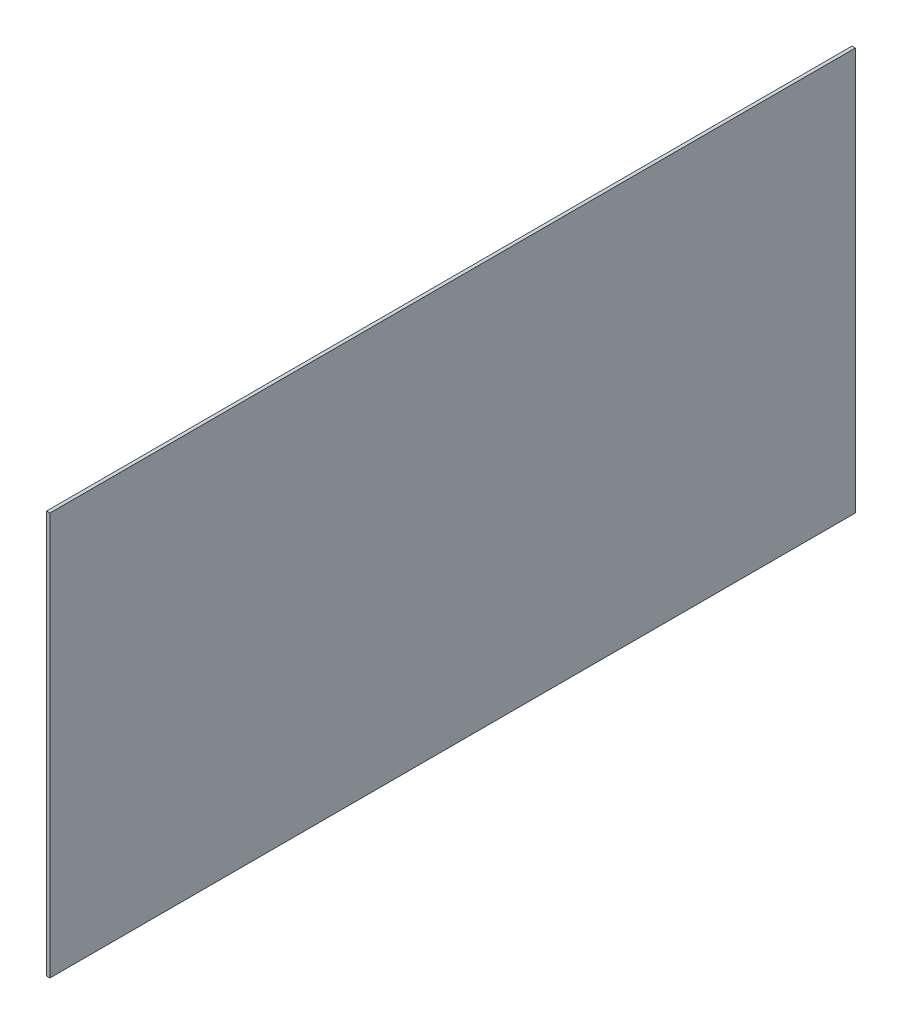
ISO-10303-21;
HEADER;
FILE_DESCRIPTION(('STEP AP214'),'2;1');
FILE_NAME('part.step','',(''),(''),'','','');
FILE_SCHEMA(('AUTOMOTIVE_DESIGN { 1 0 10303 214 1 1 1 1 }'));
ENDSEC;
DATA;
#1=APPLICATION_CONTEXT('core data for automotive mechanical design processes');
#2=APPLICATION_PROTOCOL_DEFINITION('international standard','automotive_design',2000,#1);
#3=PRODUCT_CONTEXT('',#1,'mechanical');
#4=PRODUCT('Part','Part','',(#3));
#5=PRODUCT_RELATED_PRODUCT_CATEGORY('part','',(#4));
#6=PRODUCT_DEFINITION_FORMATION('','',#4);
#7=PRODUCT_DEFINITION_CONTEXT('part definition',#1,'design');
#8=PRODUCT_DEFINITION('design','',#6,#7);
#9=PRODUCT_DEFINITION_SHAPE('','',#8);
#10=(LENGTH_UNIT() NAMED_UNIT(*) SI_UNIT(.MILLI.,.METRE.));
#11=(NAMED_UNIT(*) PLANE_ANGLE_UNIT() SI_UNIT($,.RADIAN.));
#12=(NAMED_UNIT(*) SI_UNIT($,.STERADIAN.) SOLID_ANGLE_UNIT());
#13=UNCERTAINTY_MEASURE_WITH_UNIT(LENGTH_MEASURE(1.E-05),#10,'distance_accuracy_value','');
#14=(GEOMETRIC_REPRESENTATION_CONTEXT(3) GLOBAL_UNCERTAINTY_ASSIGNED_CONTEXT((#13)) GLOBAL_UNIT_ASSIGNED_CONTEXT((#10,
#11,#12)) REPRESENTATION_CONTEXT('',''));
#15=CARTESIAN_POINT('',(0.,0.,0.));
#16=DIRECTION('',(0.,0.,1.));
#17=DIRECTION('',(1.,0.,0.));
#18=AXIS2_PLACEMENT_3D('',#15,#16,#17);
#19=CARTESIAN_POINT('',(2.54,152.4,-304.8));
#20=DIRECTION('',(0.,0.,1.));
#21=DIRECTION('',(1.,0.,0.));
#22=AXIS2_PLACEMENT_3D('',#19,#20,#21);
#23=PLANE('',#22);
#24=DIRECTION('',(0.,1.,0.));
#25=VECTOR('',#24,1.);
#26=CARTESIAN_POINT('',(0.,152.4,-304.8));
#27=LINE('',#26,#25);
#28=CARTESIAN_POINT('',(0.,-152.4,-304.8));
#29=VERTEX_POINT('',#28);
#30=CARTESIAN_POINT('',(0.,152.4,-304.8));
#31=VERTEX_POINT('',#30);
#32=EDGE_CURVE('E96',#29,#31,#27,.T.);
#33=ORIENTED_EDGE('',*,*,#32,.T.);
#34=DIRECTION('',(-1.,0.,0.));
#35=VECTOR('',#34,1.);
#36=CARTESIAN_POINT('',(2.54,152.4,-304.8));
#37=LINE('',#36,#35);
#38=CARTESIAN_POINT('',(2.54,152.4,-304.8));
#39=VERTEX_POINT('',#38);
#40=EDGE_CURVE('E11',#39,#31,#37,.T.);
#41=ORIENTED_EDGE('',*,*,#40,.F.);
#42=DIRECTION('',(0.,1.,0.));
#43=VECTOR('',#42,1.);
#44=CARTESIAN_POINT('',(2.54,152.4,-304.8));
#45=LINE('',#44,#43);
#46=CARTESIAN_POINT('',(2.54,-152.4,-304.8));
#47=VERTEX_POINT('',#46);
#48=EDGE_CURVE('E84',#47,#39,#45,.T.);
#49=ORIENTED_EDGE('',*,*,#48,.F.);
#50=DIRECTION('',(-1.,0.,0.));
#51=VECTOR('',#50,1.);
#52=CARTESIAN_POINT('',(2.54,-152.4,-304.8));
#53=LINE('',#52,#51);
#54=EDGE_CURVE('E92',#47,#29,#53,.T.);
#55=ORIENTED_EDGE('',*,*,#54,.T.);
#56=EDGE_LOOP('',(#33,#41,#49,#55));
#57=FACE_BOUND('',#56,.T.);
#58=ADVANCED_FACE('F33',(#57),#23,.F.);
#59=CARTESIAN_POINT('',(2.54,152.4,304.8));
#60=DIRECTION('',(0.,-1.,0.));
#61=DIRECTION('',(0.,0.,-1.));
#62=AXIS2_PLACEMENT_3D('',#59,#60,#61);
#63=PLANE('',#62);
#64=DIRECTION('',(0.,0.,1.));
#65=VECTOR('',#64,1.);
#66=CARTESIAN_POINT('',(0.,152.4,304.8));
#67=LINE('',#66,#65);
#68=CARTESIAN_POINT('',(0.,152.4,304.8));
#69=VERTEX_POINT('',#68);
#70=EDGE_CURVE('E88',#31,#69,#67,.T.);
#71=ORIENTED_EDGE('',*,*,#70,.T.);
#72=DIRECTION('',(-1.,0.,0.));
#73=VECTOR('',#72,1.);
#74=CARTESIAN_POINT('',(2.54,152.4,304.8));
#75=LINE('',#74,#73);
#76=CARTESIAN_POINT('',(2.54,152.4,304.8));
#77=VERTEX_POINT('',#76);
#78=EDGE_CURVE('E41',#77,#69,#75,.T.);
#79=ORIENTED_EDGE('',*,*,#78,.F.);
#80=DIRECTION('',(0.,0.,1.));
#81=VECTOR('',#80,1.);
#82=CARTESIAN_POINT('',(2.54,152.4,304.8));
#83=LINE('',#82,#81);
#84=EDGE_CURVE('E79',#39,#77,#83,.T.);
#85=ORIENTED_EDGE('',*,*,#84,.F.);
#86=ORIENTED_EDGE('',*,*,#40,.T.);
#87=EDGE_LOOP('',(#71,#79,#85,#86));
#88=FACE_BOUND('',#87,.T.);
#89=ADVANCED_FACE('F87',(#88),#63,.F.);
#90=CARTESIAN_POINT('',(2.54,152.4,304.8));
#91=DIRECTION('',(0.,0.,-1.));
#92=DIRECTION('',(-1.,0.,0.));
#93=AXIS2_PLACEMENT_3D('',#90,#91,#92);
#94=PLANE('',#93);
#95=DIRECTION('',(0.,-1.,0.));
#96=VECTOR('',#95,1.);
#97=CARTESIAN_POINT('',(0.,152.4,304.8));
#98=LINE('',#97,#96);
#99=CARTESIAN_POINT('',(0.,-152.4,304.8));
#100=VERTEX_POINT('',#99);
#101=EDGE_CURVE('E66',#69,#100,#98,.T.);
#102=ORIENTED_EDGE('',*,*,#101,.T.);
#103=DIRECTION('',(-1.,0.,0.));
#104=VECTOR('',#103,1.);
#105=CARTESIAN_POINT('',(2.54,-152.4,304.8));
#106=LINE('',#105,#104);
#107=CARTESIAN_POINT('',(2.54,-152.4,304.8));
#108=VERTEX_POINT('',#107);
#109=EDGE_CURVE('E89',#108,#100,#106,.T.);
#110=ORIENTED_EDGE('',*,*,#109,.F.);
#111=DIRECTION('',(0.,-1.,0.));
#112=VECTOR('',#111,1.);
#113=CARTESIAN_POINT('',(2.54,152.4,304.8));
#114=LINE('',#113,#112);
#115=EDGE_CURVE('E82',#77,#108,#114,.T.);
#116=ORIENTED_EDGE('',*,*,#115,.F.);
#117=ORIENTED_EDGE('',*,*,#78,.T.);
#118=EDGE_LOOP('',(#102,#110,#116,#117));
#119=FACE_BOUND('',#118,.T.);
#120=ADVANCED_FACE('F90',(#119),#94,.F.);
#121=CARTESIAN_POINT('',(2.54,-152.4,304.8));
#122=DIRECTION('',(0.,1.,0.));
#123=DIRECTION('',(0.,0.,1.));
#124=AXIS2_PLACEMENT_3D('',#121,#122,#123);
#125=PLANE('',#124);
#126=DIRECTION('',(0.,0.,-1.));
#127=VECTOR('',#126,1.);
#128=CARTESIAN_POINT('',(0.,-152.4,304.8));
#129=LINE('',#128,#127);
#130=EDGE_CURVE('E72',#100,#29,#129,.T.);
#131=ORIENTED_EDGE('',*,*,#130,.T.);
#132=ORIENTED_EDGE('',*,*,#54,.F.);
#133=DIRECTION('',(0.,0.,-1.));
#134=VECTOR('',#133,1.);
#135=CARTESIAN_POINT('',(2.54,-152.4,304.8));
#136=LINE('',#135,#134);
#137=EDGE_CURVE('E49',#108,#47,#136,.T.);
#138=ORIENTED_EDGE('',*,*,#137,.F.);
#139=ORIENTED_EDGE('',*,*,#109,.T.);
#140=EDGE_LOOP('',(#131,#132,#138,#139));
#141=FACE_BOUND('',#140,.T.);
#142=ADVANCED_FACE('F103',(#141),#125,.F.);
#143=CARTESIAN_POINT('',(2.54,0.,0.));
#144=DIRECTION('',(1.,0.,0.));
#145=DIRECTION('',(0.,0.,-1.));
#146=AXIS2_PLACEMENT_3D('',#143,#144,#145);
#147=PLANE('',#146);
#148=ORIENTED_EDGE('',*,*,#48,.T.);
#149=ORIENTED_EDGE('',*,*,#84,.T.);
#150=ORIENTED_EDGE('',*,*,#115,.T.);
#151=ORIENTED_EDGE('',*,*,#137,.T.);
#152=EDGE_LOOP('',(#148,#149,#150,#151));
#153=FACE_BOUND('',#152,.T.);
#154=ADVANCED_FACE('F80',(#153),#147,.T.);
#155=CARTESIAN_POINT('',(0.,0.,0.));
#156=DIRECTION('',(1.,0.,0.));
#157=DIRECTION('',(0.,0.,-1.));
#158=AXIS2_PLACEMENT_3D('',#155,#156,#157);
#159=PLANE('',#158);
#160=ORIENTED_EDGE('',*,*,#32,.F.);
#161=ORIENTED_EDGE('',*,*,#130,.F.);
#162=ORIENTED_EDGE('',*,*,#101,.F.);
#163=ORIENTED_EDGE('',*,*,#70,.F.);
#164=EDGE_LOOP('',(#160,#161,#162,#163));
#165=FACE_BOUND('',#164,.T.);
#166=ADVANCED_FACE('F106',(#165),#159,.F.);
#167=CLOSED_SHELL('',(#58,#89,#120,#142,#154,#166));
#168=MANIFOLD_SOLID_BREP('B2',#167);
#169=ADVANCED_BREP_SHAPE_REPRESENTATION('',(#18,#168),#14);
#170=SHAPE_DEFINITION_REPRESENTATION(#9,#169);
ENDSEC;
END-ISO-10303-21;
